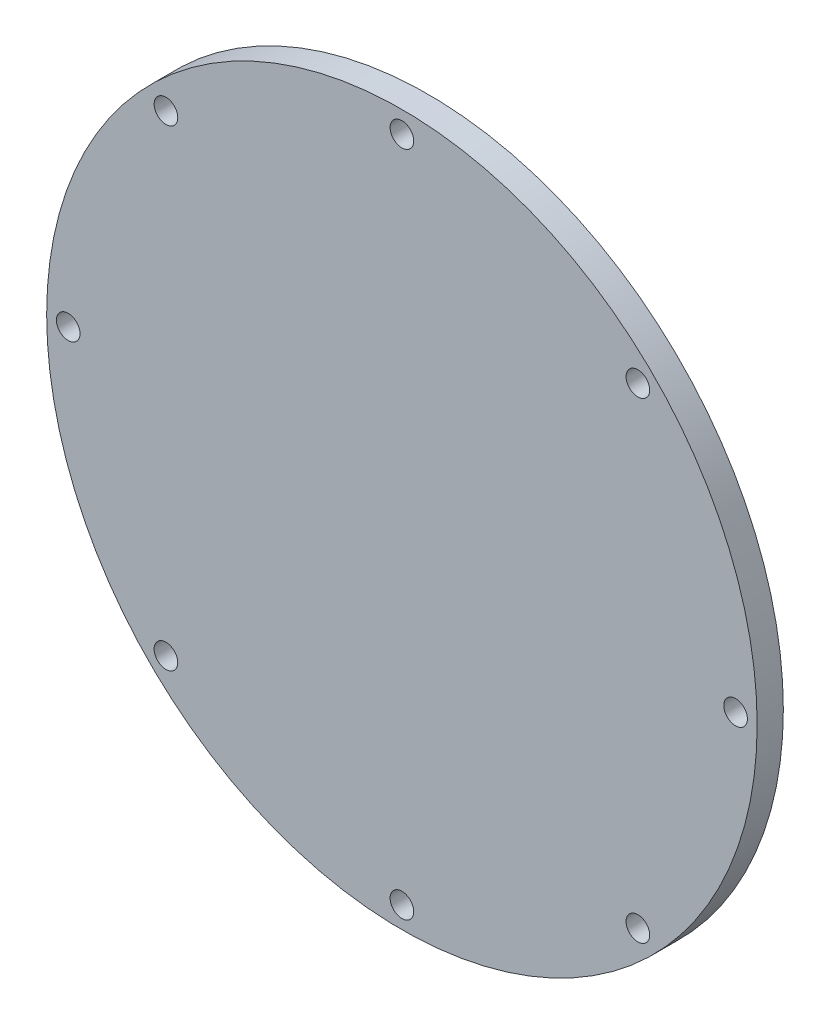
ISO-10303-21;
HEADER;
FILE_DESCRIPTION(('STEP AP214'),'2;1');
FILE_NAME('part.step','',(''),(''),'','','');
FILE_SCHEMA(('AUTOMOTIVE_DESIGN { 1 0 10303 214 1 1 1 1 }'));
ENDSEC;
DATA;
#1=APPLICATION_CONTEXT('core data for automotive mechanical design processes');
#2=APPLICATION_PROTOCOL_DEFINITION('international standard','automotive_design',2000,#1);
#3=PRODUCT_CONTEXT('',#1,'mechanical');
#4=PRODUCT('Part','Part','',(#3));
#5=PRODUCT_RELATED_PRODUCT_CATEGORY('part','',(#4));
#6=PRODUCT_DEFINITION_FORMATION('','',#4);
#7=PRODUCT_DEFINITION_CONTEXT('part definition',#1,'design');
#8=PRODUCT_DEFINITION('design','',#6,#7);
#9=PRODUCT_DEFINITION_SHAPE('','',#8);
#10=(LENGTH_UNIT() NAMED_UNIT(*) SI_UNIT(.MILLI.,.METRE.));
#11=(NAMED_UNIT(*) PLANE_ANGLE_UNIT() SI_UNIT($,.RADIAN.));
#12=(NAMED_UNIT(*) SI_UNIT($,.STERADIAN.) SOLID_ANGLE_UNIT());
#13=UNCERTAINTY_MEASURE_WITH_UNIT(LENGTH_MEASURE(1.E-05),#10,'distance_accuracy_value','');
#14=(GEOMETRIC_REPRESENTATION_CONTEXT(3) GLOBAL_UNCERTAINTY_ASSIGNED_CONTEXT((#13)) GLOBAL_UNIT_ASSIGNED_CONTEXT((#10,
#11,#12)) REPRESENTATION_CONTEXT('',''));
#15=CARTESIAN_POINT('',(0.,0.,0.));
#16=DIRECTION('',(0.,0.,1.));
#17=DIRECTION('',(1.,0.,0.));
#18=AXIS2_PLACEMENT_3D('',#15,#16,#17);
#19=CARTESIAN_POINT('',(0.,0.,0.));
#20=DIRECTION('',(0.,0.,1.));
#21=DIRECTION('',(1.,0.,0.));
#22=AXIS2_PLACEMENT_3D('',#19,#20,#21);
#23=PLANE('',#22);
#24=CARTESIAN_POINT('',(50.4780196565297,50.4780196565297,0.));
#25=DIRECTION('',(0.,0.,-1.));
#26=DIRECTION('',(-1.,0.,0.));
#27=AXIS2_PLACEMENT_3D('',#24,#25,#26);
#28=CIRCLE('',#27,2.52729999999999);
#29=CARTESIAN_POINT('',(47.9507196565297,50.4780196565297,0.));
#30=VERTEX_POINT('',#29);
#31=EDGE_CURVE('E99',#30,#30,#28,.T.);
#32=ORIENTED_EDGE('',*,*,#31,.F.);
#33=EDGE_LOOP('',(#32));
#34=FACE_BOUND('',#33,.T.);
#35=CARTESIAN_POINT('',(0.,71.3867,0.));
#36=DIRECTION('',(0.,0.,-1.));
#37=DIRECTION('',(-1.,0.,0.));
#38=AXIS2_PLACEMENT_3D('',#35,#36,#37);
#39=CIRCLE('',#38,2.52729999999999);
#40=CARTESIAN_POINT('',(-2.52729999999999,71.3867,0.));
#41=VERTEX_POINT('',#40);
#42=EDGE_CURVE('E86',#41,#41,#39,.T.);
#43=ORIENTED_EDGE('',*,*,#42,.F.);
#44=EDGE_LOOP('',(#43));
#45=FACE_BOUND('',#44,.T.);
#46=CARTESIAN_POINT('',(-50.4780196565297,50.4780196565297,0.));
#47=DIRECTION('',(0.,0.,-1.));
#48=DIRECTION('',(-1.,0.,0.));
#49=AXIS2_PLACEMENT_3D('',#46,#47,#48);
#50=CIRCLE('',#49,2.52729999999999);
#51=CARTESIAN_POINT('',(-53.0053196565297,50.4780196565297,0.));
#52=VERTEX_POINT('',#51);
#53=EDGE_CURVE('E82',#52,#52,#50,.T.);
#54=ORIENTED_EDGE('',*,*,#53,.F.);
#55=EDGE_LOOP('',(#54));
#56=FACE_BOUND('',#55,.T.);
#57=CARTESIAN_POINT('',(-71.3867,0.,0.));
#58=DIRECTION('',(0.,0.,-1.));
#59=DIRECTION('',(-1.,0.,0.));
#60=AXIS2_PLACEMENT_3D('',#57,#58,#59);
#61=CIRCLE('',#60,2.52729999999998);
#62=CARTESIAN_POINT('',(-73.914,0.,0.));
#63=VERTEX_POINT('',#62);
#64=EDGE_CURVE('E78',#63,#63,#61,.T.);
#65=ORIENTED_EDGE('',*,*,#64,.F.);
#66=EDGE_LOOP('',(#65));
#67=FACE_BOUND('',#66,.T.);
#68=CARTESIAN_POINT('',(-50.4780196565297,-50.4780196565297,0.));
#69=DIRECTION('',(0.,0.,-1.));
#70=DIRECTION('',(-1.,0.,0.));
#71=AXIS2_PLACEMENT_3D('',#68,#69,#70);
#72=CIRCLE('',#71,2.52729999999999);
#73=CARTESIAN_POINT('',(-53.0053196565297,-50.4780196565297,0.));
#74=VERTEX_POINT('',#73);
#75=EDGE_CURVE('E73',#74,#74,#72,.T.);
#76=ORIENTED_EDGE('',*,*,#75,.F.);
#77=EDGE_LOOP('',(#76));
#78=FACE_BOUND('',#77,.T.);
#79=CARTESIAN_POINT('',(0.,-71.3867,0.));
#80=DIRECTION('',(0.,0.,-1.));
#81=DIRECTION('',(-1.,0.,0.));
#82=AXIS2_PLACEMENT_3D('',#79,#80,#81);
#83=CIRCLE('',#82,2.52729999999999);
#84=CARTESIAN_POINT('',(-2.52729999999999,-71.3867,0.));
#85=VERTEX_POINT('',#84);
#86=EDGE_CURVE('E68',#85,#85,#83,.T.);
#87=ORIENTED_EDGE('',*,*,#86,.F.);
#88=EDGE_LOOP('',(#87));
#89=FACE_BOUND('',#88,.T.);
#90=CARTESIAN_POINT('',(71.3867,0.,0.));
#91=DIRECTION('',(0.,0.,-1.));
#92=DIRECTION('',(-1.,0.,0.));
#93=AXIS2_PLACEMENT_3D('',#90,#91,#92);
#94=CIRCLE('',#93,2.52729999999998);
#95=CARTESIAN_POINT('',(68.8594,0.,0.));
#96=VERTEX_POINT('',#95);
#97=EDGE_CURVE('E117',#96,#96,#94,.T.);
#98=ORIENTED_EDGE('',*,*,#97,.F.);
#99=EDGE_LOOP('',(#98));
#100=FACE_BOUND('',#99,.T.);
#101=CARTESIAN_POINT('',(0.,0.,0.));
#102=DIRECTION('',(0.,0.,1.));
#103=DIRECTION('',(1.,0.,0.));
#104=AXIS2_PLACEMENT_3D('',#101,#102,#103);
#105=CIRCLE('',#104,76.);
#106=CARTESIAN_POINT('',(76.,0.,0.));
#107=VERTEX_POINT('',#106);
#108=EDGE_CURVE('E52',#107,#107,#105,.T.);
#109=ORIENTED_EDGE('',*,*,#108,.F.);
#110=EDGE_LOOP('',(#109));
#111=FACE_BOUND('',#110,.T.);
#112=CARTESIAN_POINT('',(50.4780196565297,-50.4780196565297,0.));
#113=DIRECTION('',(0.,0.,-1.));
#114=DIRECTION('',(-1.,0.,0.));
#115=AXIS2_PLACEMENT_3D('',#112,#113,#114);
#116=CIRCLE('',#115,2.52729999999999);
#117=CARTESIAN_POINT('',(47.9507196565297,-50.4780196565297,0.));
#118=VERTEX_POINT('',#117);
#119=EDGE_CURVE('E67',#118,#118,#116,.T.);
#120=ORIENTED_EDGE('',*,*,#119,.F.);
#121=EDGE_LOOP('',(#120));
#122=FACE_BOUND('',#121,.T.);
#123=ADVANCED_FACE('F43',(#34,#45,#56,#67,#78,#89,#100,#111,#122),#23,.F.);
#124=CARTESIAN_POINT('',(0.,0.,5.6));
#125=DIRECTION('',(0.,0.,-1.));
#126=DIRECTION('',(-1.,0.,0.));
#127=AXIS2_PLACEMENT_3D('',#124,#125,#126);
#128=CYLINDRICAL_SURFACE('',#127,76.);
#129=CARTESIAN_POINT('',(0.,0.,5.6));
#130=DIRECTION('',(0.,0.,1.));
#131=DIRECTION('',(1.,0.,0.));
#132=AXIS2_PLACEMENT_3D('',#129,#130,#131);
#133=CIRCLE('',#132,76.);
#134=CARTESIAN_POINT('',(76.,0.,5.6));
#135=VERTEX_POINT('',#134);
#136=EDGE_CURVE('E10',#135,#135,#133,.T.);
#137=ORIENTED_EDGE('',*,*,#136,.F.);
#138=EDGE_LOOP('',(#137));
#139=FACE_BOUND('',#138,.T.);
#140=ORIENTED_EDGE('',*,*,#108,.T.);
#141=EDGE_LOOP('',(#140));
#142=FACE_BOUND('',#141,.T.);
#143=ADVANCED_FACE('F45',(#139,#142),#128,.T.);
#144=CARTESIAN_POINT('',(0.,0.,5.6));
#145=DIRECTION('',(0.,0.,1.));
#146=DIRECTION('',(1.,0.,0.));
#147=AXIS2_PLACEMENT_3D('',#144,#145,#146);
#148=PLANE('',#147);
#149=CARTESIAN_POINT('',(50.4780196565297,50.4780196565297,5.6));
#150=DIRECTION('',(0.,0.,1.));
#151=DIRECTION('',(1.,0.,0.));
#152=AXIS2_PLACEMENT_3D('',#149,#150,#151);
#153=CIRCLE('',#152,2.52729999999999);
#154=CARTESIAN_POINT('',(53.0053196565297,50.4780196565297,5.6));
#155=VERTEX_POINT('',#154);
#156=EDGE_CURVE('E47',#155,#155,#153,.T.);
#157=ORIENTED_EDGE('',*,*,#156,.F.);
#158=EDGE_LOOP('',(#157));
#159=FACE_BOUND('',#158,.T.);
#160=CARTESIAN_POINT('',(0.,71.3867,5.6));
#161=DIRECTION('',(0.,0.,1.));
#162=DIRECTION('',(1.,0.,0.));
#163=AXIS2_PLACEMENT_3D('',#160,#161,#162);
#164=CIRCLE('',#163,2.52729999999999);
#165=CARTESIAN_POINT('',(2.52729999999999,71.3867,5.6));
#166=VERTEX_POINT('',#165);
#167=EDGE_CURVE('E83',#166,#166,#164,.T.);
#168=ORIENTED_EDGE('',*,*,#167,.F.);
#169=EDGE_LOOP('',(#168));
#170=FACE_BOUND('',#169,.T.);
#171=CARTESIAN_POINT('',(-50.4780196565297,50.4780196565297,5.6));
#172=DIRECTION('',(0.,0.,1.));
#173=DIRECTION('',(1.,0.,0.));
#174=AXIS2_PLACEMENT_3D('',#171,#172,#173);
#175=CIRCLE('',#174,2.52729999999999);
#176=CARTESIAN_POINT('',(-47.9507196565297,50.4780196565297,5.6));
#177=VERTEX_POINT('',#176);
#178=EDGE_CURVE('E79',#177,#177,#175,.T.);
#179=ORIENTED_EDGE('',*,*,#178,.F.);
#180=EDGE_LOOP('',(#179));
#181=FACE_BOUND('',#180,.T.);
#182=CARTESIAN_POINT('',(-71.3867,0.,5.6));
#183=DIRECTION('',(0.,0.,1.));
#184=DIRECTION('',(1.,0.,0.));
#185=AXIS2_PLACEMENT_3D('',#182,#183,#184);
#186=CIRCLE('',#185,2.52729999999999);
#187=CARTESIAN_POINT('',(-68.8594,0.,5.6));
#188=VERTEX_POINT('',#187);
#189=EDGE_CURVE('E74',#188,#188,#186,.T.);
#190=ORIENTED_EDGE('',*,*,#189,.F.);
#191=EDGE_LOOP('',(#190));
#192=FACE_BOUND('',#191,.T.);
#193=CARTESIAN_POINT('',(-50.4780196565297,-50.4780196565297,5.6));
#194=DIRECTION('',(0.,0.,1.));
#195=DIRECTION('',(1.,0.,0.));
#196=AXIS2_PLACEMENT_3D('',#193,#194,#195);
#197=CIRCLE('',#196,2.52729999999999);
#198=CARTESIAN_POINT('',(-47.9507196565297,-50.4780196565297,5.6));
#199=VERTEX_POINT('',#198);
#200=EDGE_CURVE('E69',#199,#199,#197,.T.);
#201=ORIENTED_EDGE('',*,*,#200,.F.);
#202=EDGE_LOOP('',(#201));
#203=FACE_BOUND('',#202,.T.);
#204=CARTESIAN_POINT('',(0.,-71.3867,5.6));
#205=DIRECTION('',(0.,0.,1.));
#206=DIRECTION('',(1.,0.,0.));
#207=AXIS2_PLACEMENT_3D('',#204,#205,#206);
#208=CIRCLE('',#207,2.52729999999999);
#209=CARTESIAN_POINT('',(2.52729999999999,-71.3867,5.6));
#210=VERTEX_POINT('',#209);
#211=EDGE_CURVE('E63',#210,#210,#208,.T.);
#212=ORIENTED_EDGE('',*,*,#211,.F.);
#213=EDGE_LOOP('',(#212));
#214=FACE_BOUND('',#213,.T.);
#215=CARTESIAN_POINT('',(50.4780196565297,-50.4780196565297,5.6));
#216=DIRECTION('',(0.,0.,1.));
#217=DIRECTION('',(1.,0.,0.));
#218=AXIS2_PLACEMENT_3D('',#215,#216,#217);
#219=CIRCLE('',#218,2.52729999999999);
#220=CARTESIAN_POINT('',(53.0053196565297,-50.4780196565297,5.6));
#221=VERTEX_POINT('',#220);
#222=EDGE_CURVE('E114',#221,#221,#219,.T.);
#223=ORIENTED_EDGE('',*,*,#222,.F.);
#224=EDGE_LOOP('',(#223));
#225=FACE_BOUND('',#224,.T.);
#226=CARTESIAN_POINT('',(71.3867,0.,5.6));
#227=DIRECTION('',(0.,0.,1.));
#228=DIRECTION('',(1.,0.,0.));
#229=AXIS2_PLACEMENT_3D('',#226,#227,#228);
#230=CIRCLE('',#229,2.52729999999999);
#231=CARTESIAN_POINT('',(73.914,0.,5.6));
#232=VERTEX_POINT('',#231);
#233=EDGE_CURVE('E58',#232,#232,#230,.T.);
#234=ORIENTED_EDGE('',*,*,#233,.F.);
#235=EDGE_LOOP('',(#234));
#236=FACE_BOUND('',#235,.T.);
#237=ORIENTED_EDGE('',*,*,#136,.T.);
#238=EDGE_LOOP('',(#237));
#239=FACE_BOUND('',#238,.T.);
#240=ADVANCED_FACE('F128',(#159,#170,#181,#192,#203,#214,#225,#236,#239),#148,.T.);
#241=CARTESIAN_POINT('',(71.3867,0.,0.));
#242=DIRECTION('',(0.,0.,-1.));
#243=DIRECTION('',(-1.,0.,0.));
#244=AXIS2_PLACEMENT_3D('',#241,#242,#243);
#245=CYLINDRICAL_SURFACE('',#244,2.52729999999999);
#246=ORIENTED_EDGE('',*,*,#233,.T.);
#247=EDGE_LOOP('',(#246));
#248=FACE_BOUND('',#247,.T.);
#249=ORIENTED_EDGE('',*,*,#97,.T.);
#250=EDGE_LOOP('',(#249));
#251=FACE_BOUND('',#250,.T.);
#252=ADVANCED_FACE('F126',(#248,#251),#245,.F.);
#253=CARTESIAN_POINT('',(50.4780196565297,-50.4780196565297,0.));
#254=DIRECTION('',(0.,0.,-1.));
#255=DIRECTION('',(-1.,0.,0.));
#256=AXIS2_PLACEMENT_3D('',#253,#254,#255);
#257=CYLINDRICAL_SURFACE('',#256,2.52729999999999);
#258=ORIENTED_EDGE('',*,*,#222,.T.);
#259=EDGE_LOOP('',(#258));
#260=FACE_BOUND('',#259,.T.);
#261=ORIENTED_EDGE('',*,*,#119,.T.);
#262=EDGE_LOOP('',(#261));
#263=FACE_BOUND('',#262,.T.);
#264=ADVANCED_FACE('F136',(#260,#263),#257,.F.);
#265=CARTESIAN_POINT('',(0.,-71.3867,0.));
#266=DIRECTION('',(0.,0.,-1.));
#267=DIRECTION('',(-1.,0.,0.));
#268=AXIS2_PLACEMENT_3D('',#265,#266,#267);
#269=CYLINDRICAL_SURFACE('',#268,2.52729999999999);
#270=ORIENTED_EDGE('',*,*,#211,.T.);
#271=EDGE_LOOP('',(#270));
#272=FACE_BOUND('',#271,.T.);
#273=ORIENTED_EDGE('',*,*,#86,.T.);
#274=EDGE_LOOP('',(#273));
#275=FACE_BOUND('',#274,.T.);
#276=ADVANCED_FACE('F163',(#272,#275),#269,.F.);
#277=CARTESIAN_POINT('',(-50.4780196565297,-50.4780196565297,0.));
#278=DIRECTION('',(0.,0.,-1.));
#279=DIRECTION('',(-1.,0.,0.));
#280=AXIS2_PLACEMENT_3D('',#277,#278,#279);
#281=CYLINDRICAL_SURFACE('',#280,2.52729999999999);
#282=ORIENTED_EDGE('',*,*,#200,.T.);
#283=EDGE_LOOP('',(#282));
#284=FACE_BOUND('',#283,.T.);
#285=ORIENTED_EDGE('',*,*,#75,.T.);
#286=EDGE_LOOP('',(#285));
#287=FACE_BOUND('',#286,.T.);
#288=ADVANCED_FACE('F169',(#284,#287),#281,.F.);
#289=CARTESIAN_POINT('',(-71.3867,0.,0.));
#290=DIRECTION('',(0.,0.,-1.));
#291=DIRECTION('',(-1.,0.,0.));
#292=AXIS2_PLACEMENT_3D('',#289,#290,#291);
#293=CYLINDRICAL_SURFACE('',#292,2.52729999999999);
#294=ORIENTED_EDGE('',*,*,#189,.T.);
#295=EDGE_LOOP('',(#294));
#296=FACE_BOUND('',#295,.T.);
#297=ORIENTED_EDGE('',*,*,#64,.T.);
#298=EDGE_LOOP('',(#297));
#299=FACE_BOUND('',#298,.T.);
#300=ADVANCED_FACE('F175',(#296,#299),#293,.F.);
#301=CARTESIAN_POINT('',(-50.4780196565297,50.4780196565297,0.));
#302=DIRECTION('',(0.,0.,-1.));
#303=DIRECTION('',(-1.,0.,0.));
#304=AXIS2_PLACEMENT_3D('',#301,#302,#303);
#305=CYLINDRICAL_SURFACE('',#304,2.52729999999999);
#306=ORIENTED_EDGE('',*,*,#178,.T.);
#307=EDGE_LOOP('',(#306));
#308=FACE_BOUND('',#307,.T.);
#309=ORIENTED_EDGE('',*,*,#53,.T.);
#310=EDGE_LOOP('',(#309));
#311=FACE_BOUND('',#310,.T.);
#312=ADVANCED_FACE('F179',(#308,#311),#305,.F.);
#313=CARTESIAN_POINT('',(0.,71.3867,0.));
#314=DIRECTION('',(0.,0.,-1.));
#315=DIRECTION('',(-1.,0.,0.));
#316=AXIS2_PLACEMENT_3D('',#313,#314,#315);
#317=CYLINDRICAL_SURFACE('',#316,2.52729999999999);
#318=ORIENTED_EDGE('',*,*,#167,.T.);
#319=EDGE_LOOP('',(#318));
#320=FACE_BOUND('',#319,.T.);
#321=ORIENTED_EDGE('',*,*,#42,.T.);
#322=EDGE_LOOP('',(#321));
#323=FACE_BOUND('',#322,.T.);
#324=ADVANCED_FACE('F183',(#320,#323),#317,.F.);
#325=CARTESIAN_POINT('',(50.4780196565297,50.4780196565297,0.));
#326=DIRECTION('',(0.,0.,-1.));
#327=DIRECTION('',(-1.,0.,0.));
#328=AXIS2_PLACEMENT_3D('',#325,#326,#327);
#329=CYLINDRICAL_SURFACE('',#328,2.52729999999999);
#330=ORIENTED_EDGE('',*,*,#156,.T.);
#331=EDGE_LOOP('',(#330));
#332=FACE_BOUND('',#331,.T.);
#333=ORIENTED_EDGE('',*,*,#31,.T.);
#334=EDGE_LOOP('',(#333));
#335=FACE_BOUND('',#334,.T.);
#336=ADVANCED_FACE('F187',(#332,#335),#329,.F.);
#337=CLOSED_SHELL('',(#123,#143,#240,#252,#264,#276,#288,#300,#312,#324,#336));
#338=MANIFOLD_SOLID_BREP('B2',#337);
#339=ADVANCED_BREP_SHAPE_REPRESENTATION('',(#18,#338),#14);
#340=SHAPE_DEFINITION_REPRESENTATION(#9,#339);
ENDSEC;
END-ISO-10303-21;
